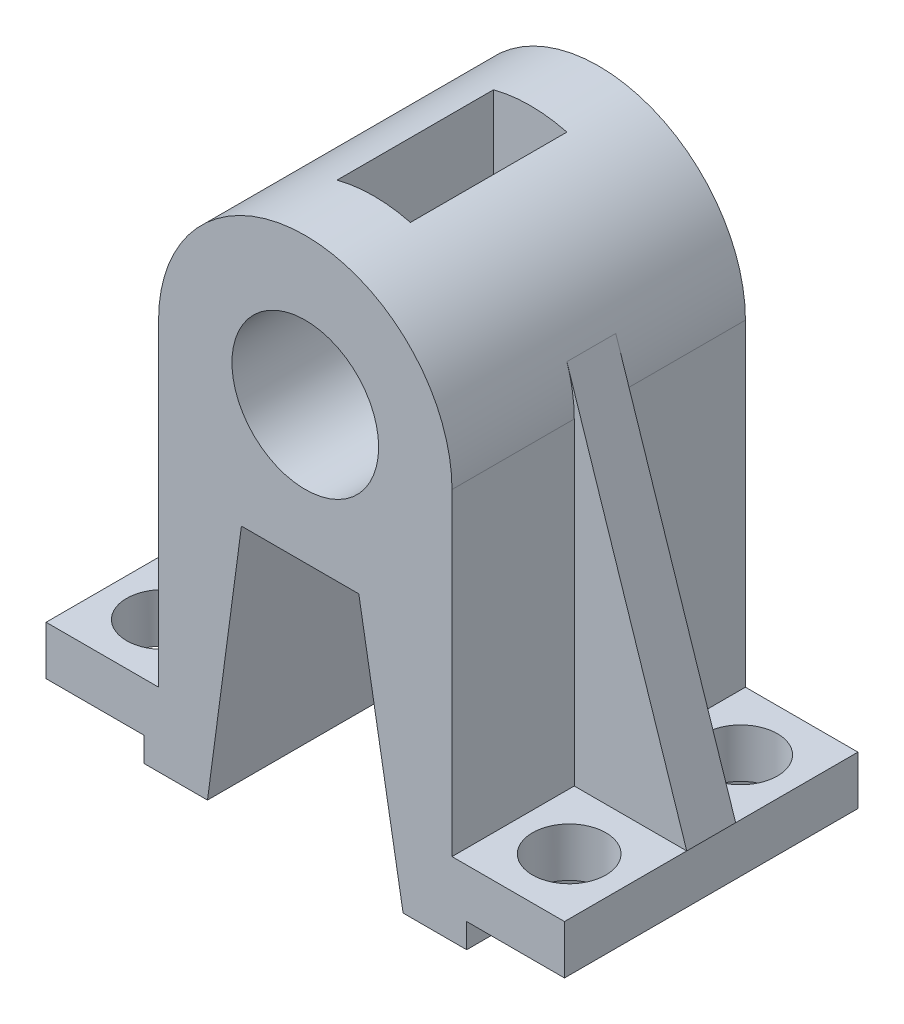
ISO-10303-21;
HEADER;
FILE_DESCRIPTION(('STEP AP214'),'2;1');
FILE_NAME('part.step','',(''),(''),'','','');
FILE_SCHEMA(('AUTOMOTIVE_DESIGN { 1 0 10303 214 1 1 1 1 }'));
ENDSEC;
DATA;
#1=APPLICATION_CONTEXT('core data for automotive mechanical design processes');
#2=APPLICATION_PROTOCOL_DEFINITION('international standard','automotive_design',2000,#1);
#3=PRODUCT_CONTEXT('',#1,'mechanical');
#4=PRODUCT('Part','Part','',(#3));
#5=PRODUCT_RELATED_PRODUCT_CATEGORY('part','',(#4));
#6=PRODUCT_DEFINITION_FORMATION('','',#4);
#7=PRODUCT_DEFINITION_CONTEXT('part definition',#1,'design');
#8=PRODUCT_DEFINITION('design','',#6,#7);
#9=PRODUCT_DEFINITION_SHAPE('','',#8);
#10=(LENGTH_UNIT() NAMED_UNIT(*) SI_UNIT(.MILLI.,.METRE.));
#11=(NAMED_UNIT(*) PLANE_ANGLE_UNIT() SI_UNIT($,.RADIAN.));
#12=(NAMED_UNIT(*) SI_UNIT($,.STERADIAN.) SOLID_ANGLE_UNIT());
#13=UNCERTAINTY_MEASURE_WITH_UNIT(LENGTH_MEASURE(1.E-05),#10,'distance_accuracy_value','');
#14=(GEOMETRIC_REPRESENTATION_CONTEXT(3) GLOBAL_UNCERTAINTY_ASSIGNED_CONTEXT((#13)) GLOBAL_UNIT_ASSIGNED_CONTEXT((#10,
#11,#12)) REPRESENTATION_CONTEXT('',''));
#15=CARTESIAN_POINT('',(0.,0.,0.));
#16=DIRECTION('',(0.,0.,1.));
#17=DIRECTION('',(1.,0.,0.));
#18=AXIS2_PLACEMENT_3D('',#15,#16,#17);
#19=CARTESIAN_POINT('',(30.,0.,30.));
#20=DIRECTION('',(1.,0.,0.));
#21=DIRECTION('',(0.,1.,0.));
#22=AXIS2_PLACEMENT_3D('',#19,#20,#21);
#23=PLANE('',#22);
#24=DIRECTION('',(0.,0.,-1.));
#25=VECTOR('',#24,1.);
#26=CARTESIAN_POINT('',(30.,0.,30.));
#27=LINE('',#26,#25);
#28=CARTESIAN_POINT('',(30.,0.,-5.));
#29=VERTEX_POINT('',#28);
#30=CARTESIAN_POINT('',(30.,0.,-30.));
#31=VERTEX_POINT('',#30);
#32=EDGE_CURVE('E528',#29,#31,#27,.T.);
#33=ORIENTED_EDGE('',*,*,#32,.F.);
#34=DIRECTION('',(0.,-1.,0.));
#35=VECTOR('',#34,1.);
#36=CARTESIAN_POINT('',(30.,0.,-5.));
#37=LINE('',#36,#35);
#38=CARTESIAN_POINT('',(30.,-65.,-5.));
#39=VERTEX_POINT('',#38);
#40=EDGE_CURVE('E225',#29,#39,#37,.T.);
#41=ORIENTED_EDGE('',*,*,#40,.T.);
#42=DIRECTION('',(0.,0.,-1.));
#43=VECTOR('',#42,1.);
#44=CARTESIAN_POINT('',(30.,-65.,30.));
#45=LINE('',#44,#43);
#46=CARTESIAN_POINT('',(30.,-65.,-30.));
#47=VERTEX_POINT('',#46);
#48=EDGE_CURVE('E406',#39,#47,#45,.T.);
#49=ORIENTED_EDGE('',*,*,#48,.T.);
#50=DIRECTION('',(0.,-1.,0.));
#51=VECTOR('',#50,1.);
#52=CARTESIAN_POINT('',(30.,0.,-30.));
#53=LINE('',#52,#51);
#54=EDGE_CURVE('E410',#31,#47,#53,.T.);
#55=ORIENTED_EDGE('',*,*,#54,.F.);
#56=EDGE_LOOP('',(#33,#41,#49,#55));
#57=FACE_BOUND('',#56,.T.);
#58=ADVANCED_FACE('F39',(#57),#23,.T.);
#59=CARTESIAN_POINT('',(0.,-65.,30.));
#60=DIRECTION('',(0.,1.,0.));
#61=DIRECTION('',(0.,0.,1.));
#62=AXIS2_PLACEMENT_3D('',#59,#60,#61);
#63=PLANE('',#62);
#64=CARTESIAN_POINT('',(41.5,-65.,-17.5380748406784));
#65=DIRECTION('',(0.,1.,0.));
#66=DIRECTION('',(0.,0.,1.));
#67=AXIS2_PLACEMENT_3D('',#64,#65,#66);
#68=CIRCLE('',#67,7.5);
#69=CARTESIAN_POINT('',(41.5,-65.,-10.0380748406784));
#70=VERTEX_POINT('',#69);
#71=EDGE_CURVE('E320',#70,#70,#68,.T.);
#72=ORIENTED_EDGE('',*,*,#71,.F.);
#73=EDGE_LOOP('',(#72));
#74=FACE_BOUND('',#73,.T.);
#75=ORIENTED_EDGE('',*,*,#48,.F.);
#76=DIRECTION('',(1.,0.,0.));
#77=VECTOR('',#76,1.);
#78=CARTESIAN_POINT('',(0.,-65.,-5.));
#79=LINE('',#78,#77);
#80=CARTESIAN_POINT('',(53.,-65.,-5.));
#81=VERTEX_POINT('',#80);
#82=EDGE_CURVE('E621',#39,#81,#79,.T.);
#83=ORIENTED_EDGE('',*,*,#82,.T.);
#84=DIRECTION('',(0.,0.,-1.));
#85=VECTOR('',#84,1.);
#86=CARTESIAN_POINT('',(53.,-65.,30.));
#87=LINE('',#86,#85);
#88=CARTESIAN_POINT('',(53.,-65.,-30.));
#89=VERTEX_POINT('',#88);
#90=EDGE_CURVE('E477',#81,#89,#87,.T.);
#91=ORIENTED_EDGE('',*,*,#90,.T.);
#92=DIRECTION('',(1.,0.,0.));
#93=VECTOR('',#92,1.);
#94=CARTESIAN_POINT('',(0.,-65.,-30.));
#95=LINE('',#94,#93);
#96=EDGE_CURVE('E343',#47,#89,#95,.T.);
#97=ORIENTED_EDGE('',*,*,#96,.F.);
#98=EDGE_LOOP('',(#75,#83,#91,#97));
#99=FACE_BOUND('',#98,.T.);
#100=ADVANCED_FACE('F581',(#74,#99),#63,.T.);
#101=CARTESIAN_POINT('',(-30.,0.,30.));
#102=DIRECTION('',(1.,0.,0.));
#103=DIRECTION('',(0.,1.,0.));
#104=AXIS2_PLACEMENT_3D('',#101,#102,#103);
#105=PLANE('',#104);
#106=DIRECTION('',(0.,-1.,0.));
#107=VECTOR('',#106,1.);
#108=CARTESIAN_POINT('',(-30.,0.,-5.));
#109=LINE('',#108,#107);
#110=CARTESIAN_POINT('',(-30.,0.,-5.));
#111=VERTEX_POINT('',#110);
#112=CARTESIAN_POINT('',(-30.,-65.,-5.));
#113=VERTEX_POINT('',#112);
#114=EDGE_CURVE('E263',#111,#113,#109,.T.);
#115=ORIENTED_EDGE('',*,*,#114,.F.);
#116=DIRECTION('',(0.,0.,-1.));
#117=VECTOR('',#116,1.);
#118=CARTESIAN_POINT('',(-30.,0.,30.));
#119=LINE('',#118,#117);
#120=CARTESIAN_POINT('',(-30.,0.,-30.));
#121=VERTEX_POINT('',#120);
#122=EDGE_CURVE('E523',#111,#121,#119,.T.);
#123=ORIENTED_EDGE('',*,*,#122,.T.);
#124=DIRECTION('',(0.,-1.,0.));
#125=VECTOR('',#124,1.);
#126=CARTESIAN_POINT('',(-30.,0.,-30.));
#127=LINE('',#126,#125);
#128=CARTESIAN_POINT('',(-30.,-65.,-30.));
#129=VERTEX_POINT('',#128);
#130=EDGE_CURVE('E418',#121,#129,#127,.T.);
#131=ORIENTED_EDGE('',*,*,#130,.T.);
#132=DIRECTION('',(0.,0.,-1.));
#133=VECTOR('',#132,1.);
#134=CARTESIAN_POINT('',(-30.,-65.,30.));
#135=LINE('',#134,#133);
#136=EDGE_CURVE('E517',#113,#129,#135,.T.);
#137=ORIENTED_EDGE('',*,*,#136,.F.);
#138=EDGE_LOOP('',(#115,#123,#131,#137));
#139=FACE_BOUND('',#138,.T.);
#140=ADVANCED_FACE('F587',(#139),#105,.F.);
#141=CARTESIAN_POINT('',(0.,-65.,30.));
#142=DIRECTION('',(0.,-1.,0.));
#143=DIRECTION('',(0.,0.,-1.));
#144=AXIS2_PLACEMENT_3D('',#141,#142,#143);
#145=PLANE('',#144);
#146=CARTESIAN_POINT('',(-41.5,-65.,-17.5380748406784));
#147=DIRECTION('',(0.,-1.,0.));
#148=DIRECTION('',(0.,0.,1.));
#149=AXIS2_PLACEMENT_3D('',#146,#147,#148);
#150=CIRCLE('',#149,7.5);
#151=CARTESIAN_POINT('',(-41.5,-65.,-10.0380748406784));
#152=VERTEX_POINT('',#151);
#153=EDGE_CURVE('E312',#152,#152,#150,.T.);
#154=ORIENTED_EDGE('',*,*,#153,.T.);
#155=EDGE_LOOP('',(#154));
#156=FACE_BOUND('',#155,.T.);
#157=DIRECTION('',(-1.,0.,0.));
#158=VECTOR('',#157,1.);
#159=CARTESIAN_POINT('',(0.,-65.,-5.));
#160=LINE('',#159,#158);
#161=CARTESIAN_POINT('',(-53.,-65.,-5.));
#162=VERTEX_POINT('',#161);
#163=EDGE_CURVE('E266',#113,#162,#160,.T.);
#164=ORIENTED_EDGE('',*,*,#163,.F.);
#165=ORIENTED_EDGE('',*,*,#136,.T.);
#166=DIRECTION('',(-1.,0.,0.));
#167=VECTOR('',#166,1.);
#168=CARTESIAN_POINT('',(0.,-65.,-30.));
#169=LINE('',#168,#167);
#170=CARTESIAN_POINT('',(-53.,-65.,-30.));
#171=VERTEX_POINT('',#170);
#172=EDGE_CURVE('E422',#129,#171,#169,.T.);
#173=ORIENTED_EDGE('',*,*,#172,.T.);
#174=DIRECTION('',(0.,0.,-1.));
#175=VECTOR('',#174,1.);
#176=CARTESIAN_POINT('',(-53.,-65.,30.));
#177=LINE('',#176,#175);
#178=EDGE_CURVE('E512',#162,#171,#177,.T.);
#179=ORIENTED_EDGE('',*,*,#178,.F.);
#180=EDGE_LOOP('',(#164,#165,#173,#179));
#181=FACE_BOUND('',#180,.T.);
#182=ADVANCED_FACE('F657',(#156,#181),#145,.F.);
#183=CARTESIAN_POINT('',(0.,0.,30.));
#184=DIRECTION('',(0.,0.,-1.));
#185=DIRECTION('',(-1.,0.,0.));
#186=AXIS2_PLACEMENT_3D('',#183,#184,#185);
#187=CYLINDRICAL_SURFACE('',#186,30.);
#188=CARTESIAN_POINT('',(0.,0.,-16.));
#189=DIRECTION('',(0.,0.,1.));
#190=DIRECTION('',(1.,0.,0.));
#191=AXIS2_PLACEMENT_3D('',#188,#189,#190);
#192=CIRCLE('',#191,30.);
#193=CARTESIAN_POINT('',(7.5,29.0473750965556,-16.));
#194=VERTEX_POINT('',#193);
#195=CARTESIAN_POINT('',(-7.5,29.0473750965556,-16.));
#196=VERTEX_POINT('',#195);
#197=EDGE_CURVE('E305',#194,#196,#192,.T.);
#198=ORIENTED_EDGE('',*,*,#197,.F.);
#199=DIRECTION('',(0.,0.,-1.));
#200=VECTOR('',#199,1.);
#201=CARTESIAN_POINT('',(7.5,29.0473750965556,30.));
#202=LINE('',#201,#200);
#203=CARTESIAN_POINT('',(7.5,29.0473750965556,16.));
#204=VERTEX_POINT('',#203);
#205=EDGE_CURVE('E308',#204,#194,#202,.T.);
#206=ORIENTED_EDGE('',*,*,#205,.F.);
#207=CARTESIAN_POINT('',(0.,0.,16.));
#208=DIRECTION('',(0.,0.,-1.));
#209=DIRECTION('',(-1.,0.,0.));
#210=AXIS2_PLACEMENT_3D('',#207,#208,#209);
#211=CIRCLE('',#210,30.);
#212=CARTESIAN_POINT('',(-7.5,29.0473750965556,16.));
#213=VERTEX_POINT('',#212);
#214=EDGE_CURVE('E299',#213,#204,#211,.T.);
#215=ORIENTED_EDGE('',*,*,#214,.F.);
#216=DIRECTION('',(0.,0.,-1.));
#217=VECTOR('',#216,1.);
#218=CARTESIAN_POINT('',(-7.5,29.0473750965556,30.));
#219=LINE('',#218,#217);
#220=EDGE_CURVE('E302',#196,#213,#219,.F.);
#221=ORIENTED_EDGE('',*,*,#220,.F.);
#222=EDGE_LOOP('',(#198,#206,#215,#221));
#223=FACE_BOUND('',#222,.T.);
#224=CARTESIAN_POINT('',(0.,0.,5.));
#225=DIRECTION('',(0.,0.,1.));
#226=DIRECTION('',(1.,0.,0.));
#227=AXIS2_PLACEMENT_3D('',#224,#225,#226);
#228=CIRCLE('',#227,30.);
#229=CARTESIAN_POINT('',(30.,0.,5.));
#230=VERTEX_POINT('',#229);
#231=CARTESIAN_POINT('',(28.493562858085,9.38705894582315,5.));
#232=VERTEX_POINT('',#231);
#233=EDGE_CURVE('E246',#230,#232,#228,.T.);
#234=ORIENTED_EDGE('',*,*,#233,.T.);
#235=DIRECTION('',(0.,0.,-1.));
#236=VECTOR('',#235,1.);
#237=CARTESIAN_POINT('',(28.493562858085,9.38705894582316,30.));
#238=LINE('',#237,#236);
#239=CARTESIAN_POINT('',(28.493562858085,9.38705894582315,-5.));
#240=VERTEX_POINT('',#239);
#241=EDGE_CURVE('E235',#240,#232,#238,.F.);
#242=ORIENTED_EDGE('',*,*,#241,.F.);
#243=CARTESIAN_POINT('',(0.,0.,-5.));
#244=DIRECTION('',(0.,0.,1.));
#245=DIRECTION('',(1.,0.,0.));
#246=AXIS2_PLACEMENT_3D('',#243,#244,#245);
#247=CIRCLE('',#246,30.);
#248=EDGE_CURVE('E222',#29,#240,#247,.T.);
#249=ORIENTED_EDGE('',*,*,#248,.F.);
#250=ORIENTED_EDGE('',*,*,#32,.T.);
#251=CARTESIAN_POINT('',(0.,0.,-30.));
#252=DIRECTION('',(0.,0.,1.));
#253=DIRECTION('',(1.,0.,0.));
#254=AXIS2_PLACEMENT_3D('',#251,#252,#253);
#255=CIRCLE('',#254,30.);
#256=EDGE_CURVE('E414',#31,#121,#255,.T.);
#257=ORIENTED_EDGE('',*,*,#256,.T.);
#258=ORIENTED_EDGE('',*,*,#122,.F.);
#259=CARTESIAN_POINT('',(0.,0.,-5.));
#260=DIRECTION('',(0.,0.,1.));
#261=DIRECTION('',(1.,0.,0.));
#262=AXIS2_PLACEMENT_3D('',#259,#260,#261);
#263=CIRCLE('',#262,30.);
#264=CARTESIAN_POINT('',(-28.493562858085,9.38705894582315,-5.));
#265=VERTEX_POINT('',#264);
#266=EDGE_CURVE('E259',#265,#111,#263,.T.);
#267=ORIENTED_EDGE('',*,*,#266,.F.);
#268=DIRECTION('',(0.,0.,-1.));
#269=VECTOR('',#268,1.);
#270=CARTESIAN_POINT('',(-28.493562858085,9.38705894582316,30.));
#271=LINE('',#270,#269);
#272=CARTESIAN_POINT('',(-28.493562858085,9.38705894582315,5.));
#273=VERTEX_POINT('',#272);
#274=EDGE_CURVE('E281',#273,#265,#271,.T.);
#275=ORIENTED_EDGE('',*,*,#274,.F.);
#276=CARTESIAN_POINT('',(0.,0.,5.));
#277=DIRECTION('',(0.,0.,1.));
#278=DIRECTION('',(1.,0.,0.));
#279=AXIS2_PLACEMENT_3D('',#276,#277,#278);
#280=CIRCLE('',#279,30.);
#281=CARTESIAN_POINT('',(-30.,0.,5.));
#282=VERTEX_POINT('',#281);
#283=EDGE_CURVE('E269',#273,#282,#280,.T.);
#284=ORIENTED_EDGE('',*,*,#283,.T.);
#285=CARTESIAN_POINT('',(-30.,0.,30.));
#286=VERTEX_POINT('',#285);
#287=EDGE_CURVE('E524',#286,#282,#119,.T.);
#288=ORIENTED_EDGE('',*,*,#287,.F.);
#289=CARTESIAN_POINT('',(0.,0.,30.));
#290=DIRECTION('',(0.,0.,1.));
#291=DIRECTION('',(1.,0.,0.));
#292=AXIS2_PLACEMENT_3D('',#289,#290,#291);
#293=CIRCLE('',#292,30.);
#294=CARTESIAN_POINT('',(30.,0.,30.));
#295=VERTEX_POINT('',#294);
#296=EDGE_CURVE('E347',#295,#286,#293,.T.);
#297=ORIENTED_EDGE('',*,*,#296,.F.);
#298=EDGE_CURVE('E529',#295,#230,#27,.T.);
#299=ORIENTED_EDGE('',*,*,#298,.T.);
#300=EDGE_LOOP('',(#234,#242,#249,#250,#257,#258,#267,#275,#284,#288,#297,#299));
#301=FACE_BOUND('',#300,.T.);
#302=ADVANCED_FACE('F244',(#223,#301),#187,.T.);
#303=CARTESIAN_POINT('',(0.,0.,30.));
#304=DIRECTION('',(0.,0.,-1.));
#305=DIRECTION('',(-1.,0.,0.));
#306=AXIS2_PLACEMENT_3D('',#303,#304,#305);
#307=CYLINDRICAL_SURFACE('',#306,15.);
#308=DIRECTION('',(0.,0.,-1.));
#309=VECTOR('',#308,1.);
#310=CARTESIAN_POINT('',(7.5,12.9903810567666,30.));
#311=LINE('',#310,#309);
#312=CARTESIAN_POINT('',(7.5,12.9903810567666,16.));
#313=VERTEX_POINT('',#312);
#314=CARTESIAN_POINT('',(7.5,12.9903810567666,-16.));
#315=VERTEX_POINT('',#314);
#316=EDGE_CURVE('E11',#313,#315,#311,.T.);
#317=ORIENTED_EDGE('',*,*,#316,.T.);
#318=CARTESIAN_POINT('',(0.,0.,-16.));
#319=DIRECTION('',(0.,0.,1.));
#320=DIRECTION('',(1.,0.,0.));
#321=AXIS2_PLACEMENT_3D('',#318,#319,#320);
#322=CIRCLE('',#321,15.);
#323=CARTESIAN_POINT('',(-7.5,12.9903810567666,-16.));
#324=VERTEX_POINT('',#323);
#325=EDGE_CURVE('E48',#315,#324,#322,.T.);
#326=ORIENTED_EDGE('',*,*,#325,.T.);
#327=DIRECTION('',(0.,0.,-1.));
#328=VECTOR('',#327,1.);
#329=CARTESIAN_POINT('',(-7.5,12.9903810567666,30.));
#330=LINE('',#329,#328);
#331=CARTESIAN_POINT('',(-7.5,12.9903810567666,16.));
#332=VERTEX_POINT('',#331);
#333=EDGE_CURVE('E542',#324,#332,#330,.F.);
#334=ORIENTED_EDGE('',*,*,#333,.T.);
#335=CARTESIAN_POINT('',(0.,0.,16.));
#336=DIRECTION('',(0.,0.,-1.));
#337=DIRECTION('',(-1.,0.,0.));
#338=AXIS2_PLACEMENT_3D('',#335,#336,#337);
#339=CIRCLE('',#338,15.);
#340=EDGE_CURVE('E532',#332,#313,#339,.T.);
#341=ORIENTED_EDGE('',*,*,#340,.T.);
#342=EDGE_LOOP('',(#317,#326,#334,#341));
#343=FACE_BOUND('',#342,.T.);
#344=CARTESIAN_POINT('',(0.,0.,30.));
#345=DIRECTION('',(0.,0.,1.));
#346=DIRECTION('',(1.,0.,0.));
#347=AXIS2_PLACEMENT_3D('',#344,#345,#346);
#348=CIRCLE('',#347,15.);
#349=CARTESIAN_POINT('',(15.,0.,30.));
#350=VERTEX_POINT('',#349);
#351=EDGE_CURVE('E338',#350,#350,#348,.T.);
#352=ORIENTED_EDGE('',*,*,#351,.T.);
#353=EDGE_LOOP('',(#352));
#354=FACE_BOUND('',#353,.T.);
#355=CARTESIAN_POINT('',(0.,0.,-30.));
#356=DIRECTION('',(0.,0.,1.));
#357=DIRECTION('',(1.,0.,0.));
#358=AXIS2_PLACEMENT_3D('',#355,#356,#357);
#359=CIRCLE('',#358,15.);
#360=CARTESIAN_POINT('',(15.,0.,-30.));
#361=VERTEX_POINT('',#360);
#362=EDGE_CURVE('E337',#361,#361,#359,.T.);
#363=ORIENTED_EDGE('',*,*,#362,.F.);
#364=EDGE_LOOP('',(#363));
#365=FACE_BOUND('',#364,.T.);
#366=ADVANCED_FACE('F41',(#343,#354,#365),#307,.F.);
#367=DIRECTION('',(0.,-1.,0.));
#368=VECTOR('',#367,1.);
#369=CARTESIAN_POINT('',(30.,0.,5.));
#370=LINE('',#369,#368);
#371=CARTESIAN_POINT('',(30.,-65.,5.));
#372=VERTEX_POINT('',#371);
#373=EDGE_CURVE('E253',#230,#372,#370,.T.);
#374=ORIENTED_EDGE('',*,*,#373,.F.);
#375=ORIENTED_EDGE('',*,*,#298,.F.);
#376=DIRECTION('',(0.,-1.,0.));
#377=VECTOR('',#376,1.);
#378=CARTESIAN_POINT('',(30.,0.,30.));
#379=LINE('',#378,#377);
#380=CARTESIAN_POINT('',(30.,-65.,30.));
#381=VERTEX_POINT('',#380);
#382=EDGE_CURVE('E342',#295,#381,#379,.T.);
#383=ORIENTED_EDGE('',*,*,#382,.T.);
#384=EDGE_CURVE('E473',#381,#372,#45,.T.);
#385=ORIENTED_EDGE('',*,*,#384,.T.);
#386=EDGE_LOOP('',(#374,#375,#383,#385));
#387=FACE_BOUND('',#386,.T.);
#388=ADVANCED_FACE('F583',(#387),#23,.T.);
#389=ORIENTED_EDGE('',*,*,#287,.T.);
#390=DIRECTION('',(0.,-1.,0.));
#391=VECTOR('',#390,1.);
#392=CARTESIAN_POINT('',(-30.,0.,5.));
#393=LINE('',#392,#391);
#394=CARTESIAN_POINT('',(-30.,-65.,5.));
#395=VERTEX_POINT('',#394);
#396=EDGE_CURVE('E273',#282,#395,#393,.T.);
#397=ORIENTED_EDGE('',*,*,#396,.T.);
#398=CARTESIAN_POINT('',(-30.,-65.,30.));
#399=VERTEX_POINT('',#398);
#400=EDGE_CURVE('E519',#399,#395,#135,.T.);
#401=ORIENTED_EDGE('',*,*,#400,.F.);
#402=DIRECTION('',(0.,-1.,0.));
#403=VECTOR('',#402,1.);
#404=CARTESIAN_POINT('',(-30.,0.,30.));
#405=LINE('',#404,#403);
#406=EDGE_CURVE('E351',#286,#399,#405,.T.);
#407=ORIENTED_EDGE('',*,*,#406,.F.);
#408=EDGE_LOOP('',(#389,#397,#401,#407));
#409=FACE_BOUND('',#408,.T.);
#410=ADVANCED_FACE('F593',(#409),#105,.F.);
#411=CARTESIAN_POINT('',(-41.5,-65.,17.5380748406784));
#412=DIRECTION('',(0.,-1.,0.));
#413=DIRECTION('',(0.,0.,-1.));
#414=AXIS2_PLACEMENT_3D('',#411,#412,#413);
#415=CIRCLE('',#414,7.5);
#416=CARTESIAN_POINT('',(-41.5,-65.,10.0380748406784));
#417=VERTEX_POINT('',#416);
#418=EDGE_CURVE('E311',#417,#417,#415,.T.);
#419=ORIENTED_EDGE('',*,*,#418,.T.);
#420=EDGE_LOOP('',(#419));
#421=FACE_BOUND('',#420,.T.);
#422=ORIENTED_EDGE('',*,*,#400,.T.);
#423=DIRECTION('',(-1.,0.,0.));
#424=VECTOR('',#423,1.);
#425=CARTESIAN_POINT('',(0.,-65.,5.));
#426=LINE('',#425,#424);
#427=CARTESIAN_POINT('',(-53.,-65.,5.));
#428=VERTEX_POINT('',#427);
#429=EDGE_CURVE('E277',#395,#428,#426,.T.);
#430=ORIENTED_EDGE('',*,*,#429,.T.);
#431=CARTESIAN_POINT('',(-53.,-65.,30.));
#432=VERTEX_POINT('',#431);
#433=EDGE_CURVE('E513',#432,#428,#177,.T.);
#434=ORIENTED_EDGE('',*,*,#433,.F.);
#435=DIRECTION('',(-1.,0.,0.));
#436=VECTOR('',#435,1.);
#437=CARTESIAN_POINT('',(0.,-65.,30.));
#438=LINE('',#437,#436);
#439=EDGE_CURVE('E355',#399,#432,#438,.T.);
#440=ORIENTED_EDGE('',*,*,#439,.F.);
#441=EDGE_LOOP('',(#422,#430,#434,#440));
#442=FACE_BOUND('',#441,.T.);
#443=ADVANCED_FACE('F599',(#421,#442),#145,.F.);
#444=CARTESIAN_POINT('',(-53.,0.,30.));
#445=DIRECTION('',(1.,0.,0.));
#446=DIRECTION('',(0.,0.,-1.));
#447=AXIS2_PLACEMENT_3D('',#444,#445,#446);
#448=PLANE('',#447);
#449=ORIENTED_EDGE('',*,*,#433,.T.);
#450=EDGE_CURVE('E518',#428,#162,#177,.T.);
#451=ORIENTED_EDGE('',*,*,#450,.T.);
#452=ORIENTED_EDGE('',*,*,#178,.T.);
#453=DIRECTION('',(0.,-1.,0.));
#454=VECTOR('',#453,1.);
#455=CARTESIAN_POINT('',(-53.,0.,-30.));
#456=LINE('',#455,#454);
#457=CARTESIAN_POINT('',(-53.,-75.,-30.));
#458=VERTEX_POINT('',#457);
#459=EDGE_CURVE('E426',#171,#458,#456,.T.);
#460=ORIENTED_EDGE('',*,*,#459,.T.);
#461=DIRECTION('',(0.,0.,-1.));
#462=VECTOR('',#461,1.);
#463=CARTESIAN_POINT('',(-53.,-75.,30.));
#464=LINE('',#463,#462);
#465=CARTESIAN_POINT('',(-53.,-75.,30.));
#466=VERTEX_POINT('',#465);
#467=EDGE_CURVE('E509',#466,#458,#464,.T.);
#468=ORIENTED_EDGE('',*,*,#467,.F.);
#469=DIRECTION('',(0.,-1.,0.));
#470=VECTOR('',#469,1.);
#471=CARTESIAN_POINT('',(-53.,0.,30.));
#472=LINE('',#471,#470);
#473=EDGE_CURVE('E359',#432,#466,#472,.T.);
#474=ORIENTED_EDGE('',*,*,#473,.F.);
#475=EDGE_LOOP('',(#449,#451,#452,#460,#468,#474));
#476=FACE_BOUND('',#475,.T.);
#477=ADVANCED_FACE('F650',(#476),#448,.F.);
#478=CARTESIAN_POINT('',(0.,-75.,30.));
#479=DIRECTION('',(0.,1.,0.));
#480=DIRECTION('',(0.,0.,1.));
#481=AXIS2_PLACEMENT_3D('',#478,#479,#480);
#482=PLANE('',#481);
#483=CARTESIAN_POINT('',(-41.5,-75.,17.5380748406784));
#484=DIRECTION('',(0.,1.,0.));
#485=DIRECTION('',(0.,0.,1.));
#486=AXIS2_PLACEMENT_3D('',#483,#484,#485);
#487=CIRCLE('',#486,7.5);
#488=CARTESIAN_POINT('',(-41.5,-75.,25.0380748406784));
#489=VERTEX_POINT('',#488);
#490=EDGE_CURVE('E316',#489,#489,#487,.F.);
#491=ORIENTED_EDGE('',*,*,#490,.F.);
#492=EDGE_LOOP('',(#491));
#493=FACE_BOUND('',#492,.T.);
#494=ORIENTED_EDGE('',*,*,#467,.T.);
#495=DIRECTION('',(1.,0.,0.));
#496=VECTOR('',#495,1.);
#497=CARTESIAN_POINT('',(0.,-75.,-30.));
#498=LINE('',#497,#496);
#499=CARTESIAN_POINT('',(-33.,-75.,-30.));
#500=VERTEX_POINT('',#499);
#501=EDGE_CURVE('E430',#458,#500,#498,.T.);
#502=ORIENTED_EDGE('',*,*,#501,.T.);
#503=DIRECTION('',(0.,0.,-1.));
#504=VECTOR('',#503,1.);
#505=CARTESIAN_POINT('',(-33.,-75.,30.));
#506=LINE('',#505,#504);
#507=CARTESIAN_POINT('',(-33.,-75.,30.));
#508=VERTEX_POINT('',#507);
#509=EDGE_CURVE('E506',#508,#500,#506,.T.);
#510=ORIENTED_EDGE('',*,*,#509,.F.);
#511=DIRECTION('',(1.,0.,0.));
#512=VECTOR('',#511,1.);
#513=CARTESIAN_POINT('',(0.,-75.,30.));
#514=LINE('',#513,#512);
#515=EDGE_CURVE('E363',#466,#508,#514,.T.);
#516=ORIENTED_EDGE('',*,*,#515,.F.);
#517=EDGE_LOOP('',(#494,#502,#510,#516));
#518=FACE_BOUND('',#517,.T.);
#519=CARTESIAN_POINT('',(-41.5,-75.,-17.5380748406784));
#520=DIRECTION('',(0.,1.,0.));
#521=DIRECTION('',(0.,0.,1.));
#522=AXIS2_PLACEMENT_3D('',#519,#520,#521);
#523=CIRCLE('',#522,7.5);
#524=CARTESIAN_POINT('',(-41.5,-75.,-10.0380748406784));
#525=VERTEX_POINT('',#524);
#526=EDGE_CURVE('E329',#525,#525,#523,.F.);
#527=ORIENTED_EDGE('',*,*,#526,.F.);
#528=EDGE_LOOP('',(#527));
#529=FACE_BOUND('',#528,.T.);
#530=ADVANCED_FACE('F905',(#493,#518,#529),#482,.F.);
#531=CARTESIAN_POINT('',(-33.,0.,30.));
#532=DIRECTION('',(1.,0.,0.));
#533=DIRECTION('',(0.,0.,-1.));
#534=AXIS2_PLACEMENT_3D('',#531,#532,#533);
#535=PLANE('',#534);
#536=ORIENTED_EDGE('',*,*,#509,.T.);
#537=DIRECTION('',(0.,-1.,0.));
#538=VECTOR('',#537,1.);
#539=CARTESIAN_POINT('',(-33.,0.,-30.));
#540=LINE('',#539,#538);
#541=CARTESIAN_POINT('',(-33.,-80.,-30.));
#542=VERTEX_POINT('',#541);
#543=EDGE_CURVE('E434',#500,#542,#540,.T.);
#544=ORIENTED_EDGE('',*,*,#543,.T.);
#545=DIRECTION('',(0.,0.,-1.));
#546=VECTOR('',#545,1.);
#547=CARTESIAN_POINT('',(-33.,-80.,30.));
#548=LINE('',#547,#546);
#549=CARTESIAN_POINT('',(-33.,-80.,30.));
#550=VERTEX_POINT('',#549);
#551=EDGE_CURVE('E503',#550,#542,#548,.T.);
#552=ORIENTED_EDGE('',*,*,#551,.F.);
#553=DIRECTION('',(0.,-1.,0.));
#554=VECTOR('',#553,1.);
#555=CARTESIAN_POINT('',(-33.,0.,30.));
#556=LINE('',#555,#554);
#557=EDGE_CURVE('E367',#508,#550,#556,.T.);
#558=ORIENTED_EDGE('',*,*,#557,.F.);
#559=EDGE_LOOP('',(#536,#544,#552,#558));
#560=FACE_BOUND('',#559,.T.);
#561=ADVANCED_FACE('F896',(#560),#535,.F.);
#562=CARTESIAN_POINT('',(0.,-80.,30.));
#563=DIRECTION('',(0.,1.,0.));
#564=DIRECTION('',(0.,0.,1.));
#565=AXIS2_PLACEMENT_3D('',#562,#563,#564);
#566=PLANE('',#565);
#567=ORIENTED_EDGE('',*,*,#551,.T.);
#568=DIRECTION('',(1.,0.,0.));
#569=VECTOR('',#568,1.);
#570=CARTESIAN_POINT('',(0.,-80.,-30.));
#571=LINE('',#570,#569);
#572=CARTESIAN_POINT('',(-20.,-80.,-30.));
#573=VERTEX_POINT('',#572);
#574=EDGE_CURVE('E438',#542,#573,#571,.T.);
#575=ORIENTED_EDGE('',*,*,#574,.T.);
#576=DIRECTION('',(0.,0.,-1.));
#577=VECTOR('',#576,1.);
#578=CARTESIAN_POINT('',(-20.,-80.,30.));
#579=LINE('',#578,#577);
#580=CARTESIAN_POINT('',(-20.,-80.,30.));
#581=VERTEX_POINT('',#580);
#582=EDGE_CURVE('E500',#581,#573,#579,.T.);
#583=ORIENTED_EDGE('',*,*,#582,.F.);
#584=DIRECTION('',(1.,0.,0.));
#585=VECTOR('',#584,1.);
#586=CARTESIAN_POINT('',(0.,-80.,30.));
#587=LINE('',#586,#585);
#588=EDGE_CURVE('E371',#550,#581,#587,.T.);
#589=ORIENTED_EDGE('',*,*,#588,.F.);
#590=EDGE_LOOP('',(#567,#575,#583,#589));
#591=FACE_BOUND('',#590,.T.);
#592=ADVANCED_FACE('F887',(#591),#566,.F.);
#593=CARTESIAN_POINT('',(-9.15403443496058,1.22237671778239,30.));
#594=DIRECTION('',(-0.99120179773921,0.132359344810098,0.));
#595=DIRECTION('',(-0.132359344810098,-0.99120179773921,0.));
#596=AXIS2_PLACEMENT_3D('',#593,#594,#595);
#597=PLANE('',#596);
#598=ORIENTED_EDGE('',*,*,#582,.T.);
#599=DIRECTION('',(0.132359344810098,0.99120179773921,0.));
#600=VECTOR('',#599,1.);
#601=CARTESIAN_POINT('',(-9.15403443496058,1.22237671778239,-30.));
#602=LINE('',#601,#600);
#603=CARTESIAN_POINT('',(-13.0562213004218,-28.,-30.));
#604=VERTEX_POINT('',#603);
#605=EDGE_CURVE('E442',#573,#604,#602,.T.);
#606=ORIENTED_EDGE('',*,*,#605,.T.);
#607=DIRECTION('',(0.,0.,-1.));
#608=VECTOR('',#607,1.);
#609=CARTESIAN_POINT('',(-13.0562213004218,-28.,30.));
#610=LINE('',#609,#608);
#611=CARTESIAN_POINT('',(-13.0562213004218,-28.,30.));
#612=VERTEX_POINT('',#611);
#613=EDGE_CURVE('E497',#612,#604,#610,.T.);
#614=ORIENTED_EDGE('',*,*,#613,.F.);
#615=DIRECTION('',(0.132359344810098,0.99120179773921,0.));
#616=VECTOR('',#615,1.);
#617=CARTESIAN_POINT('',(-9.15403443496058,1.22237671778239,30.));
#618=LINE('',#617,#616);
#619=EDGE_CURVE('E375',#581,#612,#618,.T.);
#620=ORIENTED_EDGE('',*,*,#619,.F.);
#621=EDGE_LOOP('',(#598,#606,#614,#620));
#622=FACE_BOUND('',#621,.T.);
#623=ADVANCED_FACE('F878',(#622),#597,.F.);
#624=CARTESIAN_POINT('',(0.,-28.,30.));
#625=DIRECTION('',(0.,1.,0.));
#626=DIRECTION('',(0.,0.,1.));
#627=AXIS2_PLACEMENT_3D('',#624,#625,#626);
#628=PLANE('',#627);
#629=ORIENTED_EDGE('',*,*,#613,.T.);
#630=DIRECTION('',(1.,0.,0.));
#631=VECTOR('',#630,1.);
#632=CARTESIAN_POINT('',(0.,-28.,-30.));
#633=LINE('',#632,#631);
#634=CARTESIAN_POINT('',(10.9437786995782,-28.,-30.));
#635=VERTEX_POINT('',#634);
#636=EDGE_CURVE('E446',#604,#635,#633,.T.);
#637=ORIENTED_EDGE('',*,*,#636,.T.);
#638=DIRECTION('',(0.,0.,-1.));
#639=VECTOR('',#638,1.);
#640=CARTESIAN_POINT('',(10.9437786995782,-28.,30.));
#641=LINE('',#640,#639);
#642=CARTESIAN_POINT('',(10.9437786995782,-28.,30.));
#643=VERTEX_POINT('',#642);
#644=EDGE_CURVE('E494',#643,#635,#641,.T.);
#645=ORIENTED_EDGE('',*,*,#644,.F.);
#646=DIRECTION('',(1.,0.,0.));
#647=VECTOR('',#646,1.);
#648=CARTESIAN_POINT('',(0.,-28.,30.));
#649=LINE('',#648,#647);
#650=EDGE_CURVE('E379',#612,#643,#649,.T.);
#651=ORIENTED_EDGE('',*,*,#650,.F.);
#652=EDGE_LOOP('',(#629,#637,#645,#651));
#653=FACE_BOUND('',#652,.T.);
#654=ADVANCED_FACE('F869',(#653),#628,.F.);
#655=CARTESIAN_POINT('',(5.88874020450004,1.02557181678161,30.));
#656=DIRECTION('',(0.985170972727467,0.171575506687919,0.));
#657=DIRECTION('',(-0.171575506687919,0.985170972727467,0.));
#658=AXIS2_PLACEMENT_3D('',#655,#656,#657);
#659=PLANE('',#658);
#660=ORIENTED_EDGE('',*,*,#644,.T.);
#661=DIRECTION('',(0.171575506687919,-0.985170972727467,0.));
#662=VECTOR('',#661,1.);
#663=CARTESIAN_POINT('',(5.88874020450004,1.02557181678161,-30.));
#664=LINE('',#663,#662);
#665=CARTESIAN_POINT('',(20.,-80.,-30.));
#666=VERTEX_POINT('',#665);
#667=EDGE_CURVE('E450',#635,#666,#664,.T.);
#668=ORIENTED_EDGE('',*,*,#667,.T.);
#669=DIRECTION('',(0.,0.,-1.));
#670=VECTOR('',#669,1.);
#671=CARTESIAN_POINT('',(20.,-80.,30.));
#672=LINE('',#671,#670);
#673=CARTESIAN_POINT('',(20.,-80.,30.));
#674=VERTEX_POINT('',#673);
#675=EDGE_CURVE('E491',#674,#666,#672,.T.);
#676=ORIENTED_EDGE('',*,*,#675,.F.);
#677=DIRECTION('',(0.171575506687919,-0.985170972727467,0.));
#678=VECTOR('',#677,1.);
#679=CARTESIAN_POINT('',(5.88874020450004,1.02557181678161,30.));
#680=LINE('',#679,#678);
#681=EDGE_CURVE('E383',#643,#674,#680,.T.);
#682=ORIENTED_EDGE('',*,*,#681,.F.);
#683=EDGE_LOOP('',(#660,#668,#676,#682));
#684=FACE_BOUND('',#683,.T.);
#685=ADVANCED_FACE('F860',(#684),#659,.F.);
#686=CARTESIAN_POINT('',(0.,-80.,30.));
#687=DIRECTION('',(0.,-1.,0.));
#688=DIRECTION('',(1.,0.,0.));
#689=AXIS2_PLACEMENT_3D('',#686,#687,#688);
#690=PLANE('',#689);
#691=ORIENTED_EDGE('',*,*,#675,.T.);
#692=DIRECTION('',(-1.,0.,0.));
#693=VECTOR('',#692,1.);
#694=CARTESIAN_POINT('',(0.,-80.,-30.));
#695=LINE('',#694,#693);
#696=CARTESIAN_POINT('',(33.,-80.,-30.));
#697=VERTEX_POINT('',#696);
#698=EDGE_CURVE('E454',#697,#666,#695,.T.);
#699=ORIENTED_EDGE('',*,*,#698,.F.);
#700=DIRECTION('',(0.,0.,-1.));
#701=VECTOR('',#700,1.);
#702=CARTESIAN_POINT('',(33.,-80.,30.));
#703=LINE('',#702,#701);
#704=CARTESIAN_POINT('',(33.,-80.,30.));
#705=VERTEX_POINT('',#704);
#706=EDGE_CURVE('E488',#705,#697,#703,.T.);
#707=ORIENTED_EDGE('',*,*,#706,.F.);
#708=DIRECTION('',(-1.,0.,0.));
#709=VECTOR('',#708,1.);
#710=CARTESIAN_POINT('',(0.,-80.,30.));
#711=LINE('',#710,#709);
#712=EDGE_CURVE('E386',#705,#674,#711,.T.);
#713=ORIENTED_EDGE('',*,*,#712,.T.);
#714=EDGE_LOOP('',(#691,#699,#707,#713));
#715=FACE_BOUND('',#714,.T.);
#716=ADVANCED_FACE('F851',(#715),#690,.T.);
#717=CARTESIAN_POINT('',(33.,0.,30.));
#718=DIRECTION('',(1.,0.,0.));
#719=DIRECTION('',(0.,0.,-1.));
#720=AXIS2_PLACEMENT_3D('',#717,#718,#719);
#721=PLANE('',#720);
#722=ORIENTED_EDGE('',*,*,#706,.T.);
#723=DIRECTION('',(0.,-1.,0.));
#724=VECTOR('',#723,1.);
#725=CARTESIAN_POINT('',(33.,0.,-30.));
#726=LINE('',#725,#724);
#727=CARTESIAN_POINT('',(33.,-75.,-30.));
#728=VERTEX_POINT('',#727);
#729=EDGE_CURVE('E458',#728,#697,#726,.T.);
#730=ORIENTED_EDGE('',*,*,#729,.F.);
#731=DIRECTION('',(0.,0.,-1.));
#732=VECTOR('',#731,1.);
#733=CARTESIAN_POINT('',(33.,-75.,30.));
#734=LINE('',#733,#732);
#735=CARTESIAN_POINT('',(33.,-75.,30.));
#736=VERTEX_POINT('',#735);
#737=EDGE_CURVE('E485',#736,#728,#734,.T.);
#738=ORIENTED_EDGE('',*,*,#737,.F.);
#739=DIRECTION('',(0.,-1.,0.));
#740=VECTOR('',#739,1.);
#741=CARTESIAN_POINT('',(33.,0.,30.));
#742=LINE('',#741,#740);
#743=EDGE_CURVE('E390',#736,#705,#742,.T.);
#744=ORIENTED_EDGE('',*,*,#743,.T.);
#745=EDGE_LOOP('',(#722,#730,#738,#744));
#746=FACE_BOUND('',#745,.T.);
#747=ADVANCED_FACE('F842',(#746),#721,.T.);
#748=CARTESIAN_POINT('',(0.,-75.,30.));
#749=DIRECTION('',(0.,-1.,0.));
#750=DIRECTION('',(1.,0.,0.));
#751=AXIS2_PLACEMENT_3D('',#748,#749,#750);
#752=PLANE('',#751);
#753=ORIENTED_EDGE('',*,*,#737,.T.);
#754=DIRECTION('',(-1.,0.,0.));
#755=VECTOR('',#754,1.);
#756=CARTESIAN_POINT('',(0.,-75.,-30.));
#757=LINE('',#756,#755);
#758=CARTESIAN_POINT('',(53.,-75.,-30.));
#759=VERTEX_POINT('',#758);
#760=EDGE_CURVE('E462',#759,#728,#757,.T.);
#761=ORIENTED_EDGE('',*,*,#760,.F.);
#762=DIRECTION('',(0.,0.,-1.));
#763=VECTOR('',#762,1.);
#764=CARTESIAN_POINT('',(53.,-75.,30.));
#765=LINE('',#764,#763);
#766=CARTESIAN_POINT('',(53.,-75.,30.));
#767=VERTEX_POINT('',#766);
#768=EDGE_CURVE('E482',#767,#759,#765,.T.);
#769=ORIENTED_EDGE('',*,*,#768,.F.);
#770=DIRECTION('',(-1.,0.,0.));
#771=VECTOR('',#770,1.);
#772=CARTESIAN_POINT('',(0.,-75.,30.));
#773=LINE('',#772,#771);
#774=EDGE_CURVE('E394',#767,#736,#773,.T.);
#775=ORIENTED_EDGE('',*,*,#774,.T.);
#776=EDGE_LOOP('',(#753,#761,#769,#775));
#777=FACE_BOUND('',#776,.T.);
#778=CARTESIAN_POINT('',(41.5,-75.,17.5380748406784));
#779=DIRECTION('',(0.,-1.,0.));
#780=DIRECTION('',(1.,0.,0.));
#781=AXIS2_PLACEMENT_3D('',#778,#779,#780);
#782=CIRCLE('',#781,7.5);
#783=CARTESIAN_POINT('',(49.,-75.,17.5380748406784));
#784=VERTEX_POINT('',#783);
#785=EDGE_CURVE('E324',#784,#784,#782,.T.);
#786=ORIENTED_EDGE('',*,*,#785,.F.);
#787=EDGE_LOOP('',(#786));
#788=FACE_BOUND('',#787,.T.);
#789=CARTESIAN_POINT('',(41.5,-75.,-17.5380748406784));
#790=DIRECTION('',(0.,-1.,0.));
#791=DIRECTION('',(1.,0.,0.));
#792=AXIS2_PLACEMENT_3D('',#789,#790,#791);
#793=CIRCLE('',#792,7.5);
#794=CARTESIAN_POINT('',(49.,-75.,-17.5380748406784));
#795=VERTEX_POINT('',#794);
#796=EDGE_CURVE('E333',#795,#795,#793,.T.);
#797=ORIENTED_EDGE('',*,*,#796,.F.);
#798=EDGE_LOOP('',(#797));
#799=FACE_BOUND('',#798,.T.);
#800=ADVANCED_FACE('F834',(#777,#788,#799),#752,.T.);
#801=CARTESIAN_POINT('',(53.,0.,30.));
#802=DIRECTION('',(1.,0.,0.));
#803=DIRECTION('',(0.,0.,-1.));
#804=AXIS2_PLACEMENT_3D('',#801,#802,#803);
#805=PLANE('',#804);
#806=ORIENTED_EDGE('',*,*,#768,.T.);
#807=DIRECTION('',(0.,-1.,0.));
#808=VECTOR('',#807,1.);
#809=CARTESIAN_POINT('',(53.,0.,-30.));
#810=LINE('',#809,#808);
#811=EDGE_CURVE('E466',#89,#759,#810,.T.);
#812=ORIENTED_EDGE('',*,*,#811,.F.);
#813=ORIENTED_EDGE('',*,*,#90,.F.);
#814=CARTESIAN_POINT('',(53.,-65.,5.));
#815=VERTEX_POINT('',#814);
#816=EDGE_CURVE('E238',#815,#81,#87,.T.);
#817=ORIENTED_EDGE('',*,*,#816,.F.);
#818=CARTESIAN_POINT('',(53.,-65.,30.));
#819=VERTEX_POINT('',#818);
#820=EDGE_CURVE('E478',#819,#815,#87,.T.);
#821=ORIENTED_EDGE('',*,*,#820,.F.);
#822=DIRECTION('',(0.,-1.,0.));
#823=VECTOR('',#822,1.);
#824=CARTESIAN_POINT('',(53.,0.,30.));
#825=LINE('',#824,#823);
#826=EDGE_CURVE('E398',#819,#767,#825,.T.);
#827=ORIENTED_EDGE('',*,*,#826,.T.);
#828=EDGE_LOOP('',(#806,#812,#813,#817,#821,#827));
#829=FACE_BOUND('',#828,.T.);
#830=ADVANCED_FACE('F627',(#829),#805,.T.);
#831=DIRECTION('',(1.,0.,0.));
#832=VECTOR('',#831,1.);
#833=CARTESIAN_POINT('',(0.,-65.,5.));
#834=LINE('',#833,#832);
#835=EDGE_CURVE('E230',#372,#815,#834,.T.);
#836=ORIENTED_EDGE('',*,*,#835,.F.);
#837=ORIENTED_EDGE('',*,*,#384,.F.);
#838=DIRECTION('',(1.,0.,0.));
#839=VECTOR('',#838,1.);
#840=CARTESIAN_POINT('',(0.,-65.,30.));
#841=LINE('',#840,#839);
#842=EDGE_CURVE('E402',#381,#819,#841,.T.);
#843=ORIENTED_EDGE('',*,*,#842,.T.);
#844=ORIENTED_EDGE('',*,*,#820,.T.);
#845=EDGE_LOOP('',(#836,#837,#843,#844));
#846=FACE_BOUND('',#845,.T.);
#847=CARTESIAN_POINT('',(41.5,-65.,17.5380748406784));
#848=DIRECTION('',(0.,1.,0.));
#849=DIRECTION('',(0.,0.,-1.));
#850=AXIS2_PLACEMENT_3D('',#847,#848,#849);
#851=CIRCLE('',#850,7.5);
#852=CARTESIAN_POINT('',(41.5,-65.,10.0380748406784));
#853=VERTEX_POINT('',#852);
#854=EDGE_CURVE('E325',#853,#853,#851,.T.);
#855=ORIENTED_EDGE('',*,*,#854,.F.);
#856=EDGE_LOOP('',(#855));
#857=FACE_BOUND('',#856,.T.);
#858=ADVANCED_FACE('F590',(#846,#857),#63,.T.);
#859=CARTESIAN_POINT('',(0.,0.,30.));
#860=DIRECTION('',(0.,0.,1.));
#861=DIRECTION('',(1.,0.,0.));
#862=AXIS2_PLACEMENT_3D('',#859,#860,#861);
#863=PLANE('',#862);
#864=ORIENTED_EDGE('',*,*,#351,.F.);
#865=EDGE_LOOP('',(#864));
#866=FACE_BOUND('',#865,.T.);
#867=ORIENTED_EDGE('',*,*,#382,.F.);
#868=ORIENTED_EDGE('',*,*,#296,.T.);
#869=ORIENTED_EDGE('',*,*,#406,.T.);
#870=ORIENTED_EDGE('',*,*,#439,.T.);
#871=ORIENTED_EDGE('',*,*,#473,.T.);
#872=ORIENTED_EDGE('',*,*,#515,.T.);
#873=ORIENTED_EDGE('',*,*,#557,.T.);
#874=ORIENTED_EDGE('',*,*,#588,.T.);
#875=ORIENTED_EDGE('',*,*,#619,.T.);
#876=ORIENTED_EDGE('',*,*,#650,.T.);
#877=ORIENTED_EDGE('',*,*,#681,.T.);
#878=ORIENTED_EDGE('',*,*,#712,.F.);
#879=ORIENTED_EDGE('',*,*,#743,.F.);
#880=ORIENTED_EDGE('',*,*,#774,.F.);
#881=ORIENTED_EDGE('',*,*,#826,.F.);
#882=ORIENTED_EDGE('',*,*,#842,.F.);
#883=EDGE_LOOP('',(#867,#868,#869,#870,#871,#872,#873,#874,#875,#876,#877,#878,#879,#880,#881,#882));
#884=FACE_BOUND('',#883,.T.);
#885=ADVANCED_FACE('F611',(#866,#884),#863,.T.);
#886=CARTESIAN_POINT('',(0.,0.,-30.));
#887=DIRECTION('',(0.,0.,1.));
#888=DIRECTION('',(1.,0.,0.));
#889=AXIS2_PLACEMENT_3D('',#886,#887,#888);
#890=PLANE('',#889);
#891=ORIENTED_EDGE('',*,*,#362,.T.);
#892=EDGE_LOOP('',(#891));
#893=FACE_BOUND('',#892,.T.);
#894=ORIENTED_EDGE('',*,*,#54,.T.);
#895=ORIENTED_EDGE('',*,*,#96,.T.);
#896=ORIENTED_EDGE('',*,*,#811,.T.);
#897=ORIENTED_EDGE('',*,*,#760,.T.);
#898=ORIENTED_EDGE('',*,*,#729,.T.);
#899=ORIENTED_EDGE('',*,*,#698,.T.);
#900=ORIENTED_EDGE('',*,*,#667,.F.);
#901=ORIENTED_EDGE('',*,*,#636,.F.);
#902=ORIENTED_EDGE('',*,*,#605,.F.);
#903=ORIENTED_EDGE('',*,*,#574,.F.);
#904=ORIENTED_EDGE('',*,*,#543,.F.);
#905=ORIENTED_EDGE('',*,*,#501,.F.);
#906=ORIENTED_EDGE('',*,*,#459,.F.);
#907=ORIENTED_EDGE('',*,*,#172,.F.);
#908=ORIENTED_EDGE('',*,*,#130,.F.);
#909=ORIENTED_EDGE('',*,*,#256,.F.);
#910=EDGE_LOOP('',(#894,#895,#896,#897,#898,#899,#900,#901,#902,#903,#904,#905,#906,#907,#908,#909));
#911=FACE_BOUND('',#910,.T.);
#912=ADVANCED_FACE('F636',(#893,#911),#890,.F.);
#913=CARTESIAN_POINT('',(41.5,-125.,17.5380748406784));
#914=DIRECTION('',(0.,1.,0.));
#915=DIRECTION('',(0.,0.,1.));
#916=AXIS2_PLACEMENT_3D('',#913,#914,#915);
#917=CYLINDRICAL_SURFACE('',#916,7.5);
#918=ORIENTED_EDGE('',*,*,#785,.T.);
#919=EDGE_LOOP('',(#918));
#920=FACE_BOUND('',#919,.T.);
#921=ORIENTED_EDGE('',*,*,#854,.T.);
#922=EDGE_LOOP('',(#921));
#923=FACE_BOUND('',#922,.T.);
#924=ADVANCED_FACE('F796',(#920,#923),#917,.F.);
#925=CARTESIAN_POINT('',(41.5,-125.,-17.5380748406784));
#926=DIRECTION('',(0.,1.,0.));
#927=DIRECTION('',(0.,0.,1.));
#928=AXIS2_PLACEMENT_3D('',#925,#926,#927);
#929=CYLINDRICAL_SURFACE('',#928,7.5);
#930=ORIENTED_EDGE('',*,*,#796,.T.);
#931=EDGE_LOOP('',(#930));
#932=FACE_BOUND('',#931,.T.);
#933=ORIENTED_EDGE('',*,*,#71,.T.);
#934=EDGE_LOOP('',(#933));
#935=FACE_BOUND('',#934,.T.);
#936=ADVANCED_FACE('F787',(#932,#935),#929,.F.);
#937=CARTESIAN_POINT('',(-41.5,-125.,17.5380748406784));
#938=DIRECTION('',(0.,1.,0.));
#939=DIRECTION('',(0.,0.,1.));
#940=AXIS2_PLACEMENT_3D('',#937,#938,#939);
#941=CYLINDRICAL_SURFACE('',#940,7.5);
#942=ORIENTED_EDGE('',*,*,#418,.F.);
#943=EDGE_LOOP('',(#942));
#944=FACE_BOUND('',#943,.T.);
#945=ORIENTED_EDGE('',*,*,#490,.T.);
#946=EDGE_LOOP('',(#945));
#947=FACE_BOUND('',#946,.T.);
#948=ADVANCED_FACE('F778',(#944,#947),#941,.F.);
#949=CARTESIAN_POINT('',(-41.5,-125.,-17.5380748406784));
#950=DIRECTION('',(0.,1.,0.));
#951=DIRECTION('',(0.,0.,1.));
#952=AXIS2_PLACEMENT_3D('',#949,#950,#951);
#953=CYLINDRICAL_SURFACE('',#952,7.5);
#954=ORIENTED_EDGE('',*,*,#153,.F.);
#955=EDGE_LOOP('',(#954));
#956=FACE_BOUND('',#955,.T.);
#957=ORIENTED_EDGE('',*,*,#526,.T.);
#958=EDGE_LOOP('',(#957));
#959=FACE_BOUND('',#958,.T.);
#960=ADVANCED_FACE('F760',(#956,#959),#953,.F.);
#961=CARTESIAN_POINT('',(7.5,30.,16.));
#962=DIRECTION('',(-1.,0.,0.));
#963=DIRECTION('',(0.,0.,1.));
#964=AXIS2_PLACEMENT_3D('',#961,#962,#963);
#965=PLANE('',#964);
#966=ORIENTED_EDGE('',*,*,#205,.T.);
#967=DIRECTION('',(0.,-1.,0.));
#968=VECTOR('',#967,1.);
#969=CARTESIAN_POINT('',(7.5,30.,-16.));
#970=LINE('',#969,#968);
#971=EDGE_CURVE('E295',#194,#315,#970,.T.);
#972=ORIENTED_EDGE('',*,*,#971,.T.);
#973=ORIENTED_EDGE('',*,*,#316,.F.);
#974=DIRECTION('',(0.,-1.,0.));
#975=VECTOR('',#974,1.);
#976=CARTESIAN_POINT('',(7.5,30.,16.));
#977=LINE('',#976,#975);
#978=EDGE_CURVE('E284',#204,#313,#977,.T.);
#979=ORIENTED_EDGE('',*,*,#978,.F.);
#980=EDGE_LOOP('',(#966,#972,#973,#979));
#981=FACE_BOUND('',#980,.T.);
#982=ADVANCED_FACE('F557',(#981),#965,.T.);
#983=CARTESIAN_POINT('',(-7.5,30.,-16.));
#984=DIRECTION('',(0.,0.,1.));
#985=DIRECTION('',(1.,0.,0.));
#986=AXIS2_PLACEMENT_3D('',#983,#984,#985);
#987=PLANE('',#986);
#988=ORIENTED_EDGE('',*,*,#197,.T.);
#989=DIRECTION('',(0.,-1.,0.));
#990=VECTOR('',#989,1.);
#991=CARTESIAN_POINT('',(-7.5,30.,-16.));
#992=LINE('',#991,#990);
#993=EDGE_CURVE('E291',#196,#324,#992,.T.);
#994=ORIENTED_EDGE('',*,*,#993,.T.);
#995=ORIENTED_EDGE('',*,*,#325,.F.);
#996=ORIENTED_EDGE('',*,*,#971,.F.);
#997=EDGE_LOOP('',(#988,#994,#995,#996));
#998=FACE_BOUND('',#997,.T.);
#999=ADVANCED_FACE('F553',(#998),#987,.T.);
#1000=CARTESIAN_POINT('',(-7.5,30.,16.));
#1001=DIRECTION('',(1.,0.,0.));
#1002=DIRECTION('',(0.,0.,-1.));
#1003=AXIS2_PLACEMENT_3D('',#1000,#1001,#1002);
#1004=PLANE('',#1003);
#1005=DIRECTION('',(0.,-1.,0.));
#1006=VECTOR('',#1005,1.);
#1007=CARTESIAN_POINT('',(-7.5,30.,16.));
#1008=LINE('',#1007,#1006);
#1009=EDGE_CURVE('E287',#213,#332,#1008,.T.);
#1010=ORIENTED_EDGE('',*,*,#1009,.T.);
#1011=ORIENTED_EDGE('',*,*,#333,.F.);
#1012=ORIENTED_EDGE('',*,*,#993,.F.);
#1013=ORIENTED_EDGE('',*,*,#220,.T.);
#1014=EDGE_LOOP('',(#1010,#1011,#1012,#1013));
#1015=FACE_BOUND('',#1014,.T.);
#1016=ADVANCED_FACE('F564',(#1015),#1004,.T.);
#1017=CARTESIAN_POINT('',(-7.5,30.,16.));
#1018=DIRECTION('',(0.,0.,-1.));
#1019=DIRECTION('',(-1.,0.,0.));
#1020=AXIS2_PLACEMENT_3D('',#1017,#1018,#1019);
#1021=PLANE('',#1020);
#1022=ORIENTED_EDGE('',*,*,#214,.T.);
#1023=ORIENTED_EDGE('',*,*,#978,.T.);
#1024=ORIENTED_EDGE('',*,*,#340,.F.);
#1025=ORIENTED_EDGE('',*,*,#1009,.F.);
#1026=EDGE_LOOP('',(#1022,#1023,#1024,#1025));
#1027=FACE_BOUND('',#1026,.T.);
#1028=ADVANCED_FACE('F567',(#1027),#1021,.T.);
#1029=CARTESIAN_POINT('',(0.,-25.,5.));
#1030=DIRECTION('',(0.,0.,1.));
#1031=DIRECTION('',(1.,0.,0.));
#1032=AXIS2_PLACEMENT_3D('',#1029,#1030,#1031);
#1033=PLANE('',#1032);
#1034=ORIENTED_EDGE('',*,*,#429,.F.);
#1035=ORIENTED_EDGE('',*,*,#396,.F.);
#1036=ORIENTED_EDGE('',*,*,#283,.F.);
#1037=DIRECTION('',(-0.312901964860772,-0.949785428602833,0.));
#1038=VECTOR('',#1037,1.);
#1039=CARTESIAN_POINT('',(-28.493562858085,9.38705894582315,5.));
#1040=LINE('',#1039,#1038);
#1041=EDGE_CURVE('E251',#273,#428,#1040,.T.);
#1042=ORIENTED_EDGE('',*,*,#1041,.T.);
#1043=EDGE_LOOP('',(#1034,#1035,#1036,#1042));
#1044=FACE_BOUND('',#1043,.T.);
#1045=ADVANCED_FACE('F569',(#1044),#1033,.T.);
#1046=CARTESIAN_POINT('',(0.,-25.,-5.));
#1047=DIRECTION('',(0.,0.,1.));
#1048=DIRECTION('',(1.,0.,0.));
#1049=AXIS2_PLACEMENT_3D('',#1046,#1047,#1048);
#1050=PLANE('',#1049);
#1051=ORIENTED_EDGE('',*,*,#114,.T.);
#1052=ORIENTED_EDGE('',*,*,#163,.T.);
#1053=DIRECTION('',(-0.312901964860772,-0.949785428602833,0.));
#1054=VECTOR('',#1053,1.);
#1055=CARTESIAN_POINT('',(-28.493562858085,9.38705894582315,-5.));
#1056=LINE('',#1055,#1054);
#1057=EDGE_CURVE('E63',#265,#162,#1056,.T.);
#1058=ORIENTED_EDGE('',*,*,#1057,.F.);
#1059=ORIENTED_EDGE('',*,*,#266,.T.);
#1060=EDGE_LOOP('',(#1051,#1052,#1058,#1059));
#1061=FACE_BOUND('',#1060,.T.);
#1062=ADVANCED_FACE('F575',(#1061),#1050,.F.);
#1063=CARTESIAN_POINT('',(-28.493562858085,9.38705894582315,0.));
#1064=DIRECTION('',(-0.949785428602834,0.312901964860772,0.));
#1065=DIRECTION('',(-0.312901964860772,-0.949785428602833,0.));
#1066=AXIS2_PLACEMENT_3D('',#1063,#1064,#1065);
#1067=PLANE('',#1066);
#1068=ORIENTED_EDGE('',*,*,#1041,.F.);
#1069=ORIENTED_EDGE('',*,*,#274,.T.);
#1070=ORIENTED_EDGE('',*,*,#1057,.T.);
#1071=ORIENTED_EDGE('',*,*,#450,.F.);
#1072=EDGE_LOOP('',(#1068,#1069,#1070,#1071));
#1073=FACE_BOUND('',#1072,.T.);
#1074=ADVANCED_FACE('F666',(#1073),#1067,.T.);
#1075=CARTESIAN_POINT('',(0.,-25.,5.));
#1076=DIRECTION('',(0.,0.,1.));
#1077=DIRECTION('',(1.,0.,0.));
#1078=AXIS2_PLACEMENT_3D('',#1075,#1076,#1077);
#1079=PLANE('',#1078);
#1080=ORIENTED_EDGE('',*,*,#233,.F.);
#1081=ORIENTED_EDGE('',*,*,#373,.T.);
#1082=ORIENTED_EDGE('',*,*,#835,.T.);
#1083=DIRECTION('',(0.312901964860772,-0.949785428602833,0.));
#1084=VECTOR('',#1083,1.);
#1085=CARTESIAN_POINT('',(28.493562858085,9.38705894582315,5.));
#1086=LINE('',#1085,#1084);
#1087=EDGE_CURVE('E241',#232,#815,#1086,.T.);
#1088=ORIENTED_EDGE('',*,*,#1087,.F.);
#1089=EDGE_LOOP('',(#1080,#1081,#1082,#1088));
#1090=FACE_BOUND('',#1089,.T.);
#1091=ADVANCED_FACE('F671',(#1090),#1079,.T.);
#1092=CARTESIAN_POINT('',(0.,-25.,-5.));
#1093=DIRECTION('',(0.,0.,1.));
#1094=DIRECTION('',(1.,0.,0.));
#1095=AXIS2_PLACEMENT_3D('',#1092,#1093,#1094);
#1096=PLANE('',#1095);
#1097=ORIENTED_EDGE('',*,*,#40,.F.);
#1098=ORIENTED_EDGE('',*,*,#248,.T.);
#1099=DIRECTION('',(0.312901964860772,-0.949785428602833,0.));
#1100=VECTOR('',#1099,1.);
#1101=CARTESIAN_POINT('',(28.493562858085,9.38705894582315,-5.));
#1102=LINE('',#1101,#1100);
#1103=EDGE_CURVE('E55',#240,#81,#1102,.T.);
#1104=ORIENTED_EDGE('',*,*,#1103,.T.);
#1105=ORIENTED_EDGE('',*,*,#82,.F.);
#1106=EDGE_LOOP('',(#1097,#1098,#1104,#1105));
#1107=FACE_BOUND('',#1106,.T.);
#1108=ADVANCED_FACE('F223',(#1107),#1096,.F.);
#1109=CARTESIAN_POINT('',(28.493562858085,9.38705894582315,0.));
#1110=DIRECTION('',(-0.949785428602834,-0.312901964860772,0.));
#1111=DIRECTION('',(0.312901964860772,-0.949785428602833,0.));
#1112=AXIS2_PLACEMENT_3D('',#1109,#1110,#1111);
#1113=PLANE('',#1112);
#1114=ORIENTED_EDGE('',*,*,#1103,.F.);
#1115=ORIENTED_EDGE('',*,*,#241,.T.);
#1116=ORIENTED_EDGE('',*,*,#1087,.T.);
#1117=ORIENTED_EDGE('',*,*,#816,.T.);
#1118=EDGE_LOOP('',(#1114,#1115,#1116,#1117));
#1119=FACE_BOUND('',#1118,.T.);
#1120=ADVANCED_FACE('F233',(#1119),#1113,.F.);
#1121=CLOSED_SHELL('',(#58,#100,#140,#182,#302,#366,#388,#410,#443,#477,#530,#561,#592,#623,
#654,#685,#716,#747,#800,#830,#858,#885,#912,#924,#936,#948,#960,#982,#999,#1016,#1028,#1045,
#1062,#1074,#1091,#1108,#1120));
#1122=MANIFOLD_SOLID_BREP('B2',#1121);
#1123=ADVANCED_BREP_SHAPE_REPRESENTATION('',(#18,#1122),#14);
#1124=SHAPE_DEFINITION_REPRESENTATION(#9,#1123);
ENDSEC;
END-ISO-10303-21;
